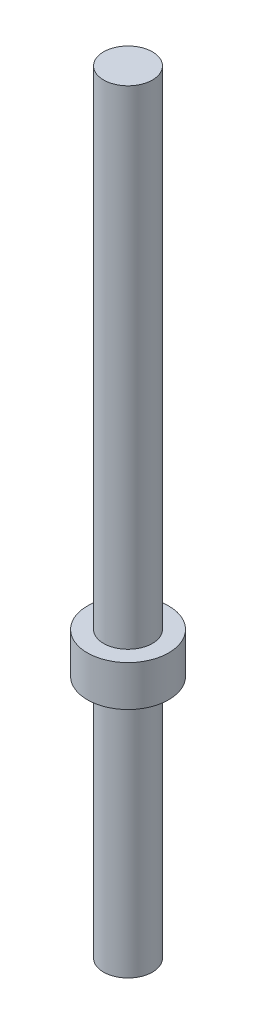
ISO-10303-21;
HEADER;
FILE_DESCRIPTION(('STEP AP214'),'2;1');
FILE_NAME('part.step','',(''),(''),'','','');
FILE_SCHEMA(('AUTOMOTIVE_DESIGN { 1 0 10303 214 1 1 1 1 }'));
ENDSEC;
DATA;
#1=APPLICATION_CONTEXT('core data for automotive mechanical design processes');
#2=APPLICATION_PROTOCOL_DEFINITION('international standard','automotive_design',2000,#1);
#3=PRODUCT_CONTEXT('',#1,'mechanical');
#4=PRODUCT('Part','Part','',(#3));
#5=PRODUCT_RELATED_PRODUCT_CATEGORY('part','',(#4));
#6=PRODUCT_DEFINITION_FORMATION('','',#4);
#7=PRODUCT_DEFINITION_CONTEXT('part definition',#1,'design');
#8=PRODUCT_DEFINITION('design','',#6,#7);
#9=PRODUCT_DEFINITION_SHAPE('','',#8);
#10=(LENGTH_UNIT() NAMED_UNIT(*) SI_UNIT(.MILLI.,.METRE.));
#11=(NAMED_UNIT(*) PLANE_ANGLE_UNIT() SI_UNIT($,.RADIAN.));
#12=(NAMED_UNIT(*) SI_UNIT($,.STERADIAN.) SOLID_ANGLE_UNIT());
#13=UNCERTAINTY_MEASURE_WITH_UNIT(LENGTH_MEASURE(1.E-05),#10,'distance_accuracy_value','');
#14=(GEOMETRIC_REPRESENTATION_CONTEXT(3) GLOBAL_UNCERTAINTY_ASSIGNED_CONTEXT((#13)) GLOBAL_UNIT_ASSIGNED_CONTEXT((#10,
#11,#12)) REPRESENTATION_CONTEXT('',''));
#15=CARTESIAN_POINT('',(0.,0.,0.));
#16=DIRECTION('',(0.,0.,1.));
#17=DIRECTION('',(1.,0.,0.));
#18=AXIS2_PLACEMENT_3D('',#15,#16,#17);
#19=CARTESIAN_POINT('',(0.,0.,0.));
#20=DIRECTION('',(0.,1.,0.));
#21=DIRECTION('',(0.,0.,1.));
#22=AXIS2_PLACEMENT_3D('',#19,#20,#21);
#23=PLANE('',#22);
#24=CARTESIAN_POINT('',(0.,0.,0.));
#25=DIRECTION('',(0.,-1.,0.));
#26=DIRECTION('',(0.,0.,-1.));
#27=AXIS2_PLACEMENT_3D('',#24,#25,#26);
#28=CIRCLE('',#27,0.5);
#29=CARTESIAN_POINT('',(0.,0.,-0.5));
#30=VERTEX_POINT('',#29);
#31=EDGE_CURVE('E47',#30,#30,#28,.T.);
#32=ORIENTED_EDGE('',*,*,#31,.T.);
#33=EDGE_LOOP('',(#32));
#34=FACE_BOUND('',#33,.T.);
#35=CARTESIAN_POINT('',(0.,0.,0.));
#36=DIRECTION('',(0.,1.,0.));
#37=DIRECTION('',(0.,0.,1.));
#38=AXIS2_PLACEMENT_3D('',#35,#36,#37);
#39=CIRCLE('',#38,0.3);
#40=CARTESIAN_POINT('',(0.,0.,0.3));
#41=VERTEX_POINT('',#40);
#42=EDGE_CURVE('E10',#41,#41,#39,.F.);
#43=ORIENTED_EDGE('',*,*,#42,.F.);
#44=EDGE_LOOP('',(#43));
#45=FACE_BOUND('',#44,.T.);
#46=ADVANCED_FACE('F29',(#34,#45),#23,.F.);
#47=CARTESIAN_POINT('',(0.,6.5,0.));
#48=DIRECTION('',(0.,-1.,0.));
#49=DIRECTION('',(0.,0.,-1.));
#50=AXIS2_PLACEMENT_3D('',#47,#48,#49);
#51=CYLINDRICAL_SURFACE('',#50,0.3);
#52=CARTESIAN_POINT('',(0.,6.5,0.));
#53=DIRECTION('',(0.,1.,0.));
#54=DIRECTION('',(0.,0.,1.));
#55=AXIS2_PLACEMENT_3D('',#52,#53,#54);
#56=CIRCLE('',#55,0.3);
#57=CARTESIAN_POINT('',(0.,6.5,0.3));
#58=VERTEX_POINT('',#57);
#59=EDGE_CURVE('E40',#58,#58,#56,.T.);
#60=ORIENTED_EDGE('',*,*,#59,.F.);
#61=EDGE_LOOP('',(#60));
#62=FACE_BOUND('',#61,.T.);
#63=CARTESIAN_POINT('',(0.,0.5,0.));
#64=DIRECTION('',(0.,-1.,0.));
#65=DIRECTION('',(0.,0.,-1.));
#66=AXIS2_PLACEMENT_3D('',#63,#64,#65);
#67=CIRCLE('',#66,0.3);
#68=CARTESIAN_POINT('',(0.,0.5,-0.3));
#69=VERTEX_POINT('',#68);
#70=EDGE_CURVE('E36',#69,#69,#67,.T.);
#71=ORIENTED_EDGE('',*,*,#70,.F.);
#72=EDGE_LOOP('',(#71));
#73=FACE_BOUND('',#72,.T.);
#74=ADVANCED_FACE('F31',(#62,#73),#51,.T.);
#75=CARTESIAN_POINT('',(0.,6.5,0.));
#76=DIRECTION('',(0.,1.,0.));
#77=DIRECTION('',(0.,0.,1.));
#78=AXIS2_PLACEMENT_3D('',#75,#76,#77);
#79=PLANE('',#78);
#80=ORIENTED_EDGE('',*,*,#59,.T.);
#81=EDGE_LOOP('',(#80));
#82=FACE_BOUND('',#81,.T.);
#83=ADVANCED_FACE('F76',(#82),#79,.T.);
#84=CARTESIAN_POINT('',(0.,0.5,0.));
#85=DIRECTION('',(0.,-1.,0.));
#86=DIRECTION('',(0.,0.,-1.));
#87=AXIS2_PLACEMENT_3D('',#84,#85,#86);
#88=PLANE('',#87);
#89=CARTESIAN_POINT('',(0.,0.5,0.));
#90=DIRECTION('',(0.,-1.,0.));
#91=DIRECTION('',(0.,0.,-1.));
#92=AXIS2_PLACEMENT_3D('',#89,#90,#91);
#93=CIRCLE('',#92,0.5);
#94=CARTESIAN_POINT('',(0.,0.5,-0.5));
#95=VERTEX_POINT('',#94);
#96=EDGE_CURVE('E44',#95,#95,#93,.T.);
#97=ORIENTED_EDGE('',*,*,#96,.F.);
#98=EDGE_LOOP('',(#97));
#99=FACE_BOUND('',#98,.T.);
#100=ORIENTED_EDGE('',*,*,#70,.T.);
#101=EDGE_LOOP('',(#100));
#102=FACE_BOUND('',#101,.T.);
#103=ADVANCED_FACE('F67',(#99,#102),#88,.F.);
#104=CARTESIAN_POINT('',(0.,0.5,0.));
#105=DIRECTION('',(0.,-1.,0.));
#106=DIRECTION('',(0.,0.,-1.));
#107=AXIS2_PLACEMENT_3D('',#104,#105,#106);
#108=CYLINDRICAL_SURFACE('',#107,0.5);
#109=ORIENTED_EDGE('',*,*,#96,.T.);
#110=EDGE_LOOP('',(#109));
#111=FACE_BOUND('',#110,.T.);
#112=ORIENTED_EDGE('',*,*,#31,.F.);
#113=EDGE_LOOP('',(#112));
#114=FACE_BOUND('',#113,.T.);
#115=ADVANCED_FACE('F60',(#111,#114),#108,.T.);
#116=CARTESIAN_POINT('',(0.,-3.,0.));
#117=DIRECTION('',(0.,1.,0.));
#118=DIRECTION('',(0.,0.,1.));
#119=AXIS2_PLACEMENT_3D('',#116,#117,#118);
#120=CYLINDRICAL_SURFACE('',#119,0.3);
#121=CARTESIAN_POINT('',(0.,-3.,0.));
#122=DIRECTION('',(0.,-1.,0.));
#123=DIRECTION('',(0.,0.,-1.));
#124=AXIS2_PLACEMENT_3D('',#121,#122,#123);
#125=CIRCLE('',#124,0.3);
#126=CARTESIAN_POINT('',(0.,-3.,-0.3));
#127=VERTEX_POINT('',#126);
#128=EDGE_CURVE('E50',#127,#127,#125,.T.);
#129=ORIENTED_EDGE('',*,*,#128,.F.);
#130=EDGE_LOOP('',(#129));
#131=FACE_BOUND('',#130,.T.);
#132=ORIENTED_EDGE('',*,*,#42,.T.);
#133=EDGE_LOOP('',(#132));
#134=FACE_BOUND('',#133,.T.);
#135=ADVANCED_FACE('F58',(#131,#134),#120,.T.);
#136=CARTESIAN_POINT('',(0.,-3.,0.));
#137=DIRECTION('',(0.,-1.,0.));
#138=DIRECTION('',(0.,0.,-1.));
#139=AXIS2_PLACEMENT_3D('',#136,#137,#138);
#140=PLANE('',#139);
#141=ORIENTED_EDGE('',*,*,#128,.T.);
#142=EDGE_LOOP('',(#141));
#143=FACE_BOUND('',#142,.T.);
#144=ADVANCED_FACE('F56',(#143),#140,.T.);
#145=CLOSED_SHELL('',(#46,#74,#83,#103,#115,#135,#144));
#146=MANIFOLD_SOLID_BREP('B2',#145);
#147=ADVANCED_BREP_SHAPE_REPRESENTATION('',(#18,#146),#14);
#148=SHAPE_DEFINITION_REPRESENTATION(#9,#147);
ENDSEC;
END-ISO-10303-21;
